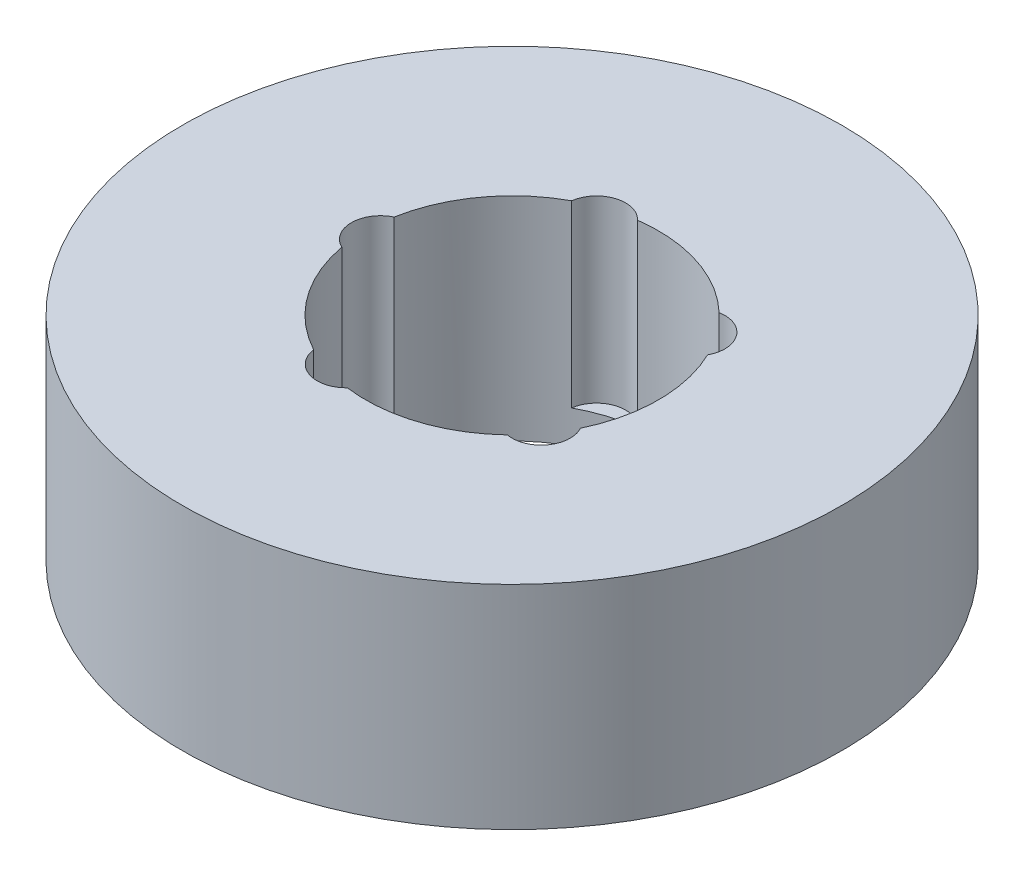
ISO-10303-21;
HEADER;
FILE_DESCRIPTION(('STEP AP214'),'2;1');
FILE_NAME('part.step','',(''),(''),'','','');
FILE_SCHEMA(('AUTOMOTIVE_DESIGN { 1 0 10303 214 1 1 1 1 }'));
ENDSEC;
DATA;
#1=APPLICATION_CONTEXT('core data for automotive mechanical design processes');
#2=APPLICATION_PROTOCOL_DEFINITION('international standard','automotive_design',2000,#1);
#3=PRODUCT_CONTEXT('',#1,'mechanical');
#4=PRODUCT('Part','Part','',(#3));
#5=PRODUCT_RELATED_PRODUCT_CATEGORY('part','',(#4));
#6=PRODUCT_DEFINITION_FORMATION('','',#4);
#7=PRODUCT_DEFINITION_CONTEXT('part definition',#1,'design');
#8=PRODUCT_DEFINITION('design','',#6,#7);
#9=PRODUCT_DEFINITION_SHAPE('','',#8);
#10=(LENGTH_UNIT() NAMED_UNIT(*) SI_UNIT(.MILLI.,.METRE.));
#11=(NAMED_UNIT(*) PLANE_ANGLE_UNIT() SI_UNIT($,.RADIAN.));
#12=(NAMED_UNIT(*) SI_UNIT($,.STERADIAN.) SOLID_ANGLE_UNIT());
#13=UNCERTAINTY_MEASURE_WITH_UNIT(LENGTH_MEASURE(1.E-05),#10,'distance_accuracy_value','');
#14=(GEOMETRIC_REPRESENTATION_CONTEXT(3) GLOBAL_UNCERTAINTY_ASSIGNED_CONTEXT((#13)) GLOBAL_UNIT_ASSIGNED_CONTEXT((#10,
#11,#12)) REPRESENTATION_CONTEXT('',''));
#15=CARTESIAN_POINT('',(0.,0.,0.));
#16=DIRECTION('',(0.,0.,1.));
#17=DIRECTION('',(1.,0.,0.));
#18=AXIS2_PLACEMENT_3D('',#15,#16,#17);
#19=CARTESIAN_POINT('',(0.,29.,0.));
#20=DIRECTION('',(0.,-1.,0.));
#21=DIRECTION('',(0.,0.,-1.));
#22=AXIS2_PLACEMENT_3D('',#19,#20,#21);
#23=CYLINDRICAL_SURFACE('',#22,45.);
#24=CARTESIAN_POINT('',(0.,29.,0.));
#25=DIRECTION('',(0.,1.,0.));
#26=DIRECTION('',(0.,0.,1.));
#27=AXIS2_PLACEMENT_3D('',#24,#25,#26);
#28=CIRCLE('',#27,45.);
#29=CARTESIAN_POINT('',(0.,29.,-45.));
#30=VERTEX_POINT('',#29);
#31=EDGE_CURVE('E151',#30,#30,#28,.T.);
#32=CARTESIAN_POINT('',(0.,0.,0.));
#33=DIRECTION('',(0.,1.,0.));
#34=DIRECTION('',(0.,0.,1.));
#35=AXIS2_PLACEMENT_3D('',#32,#33,#34);
#36=CIRCLE('',#35,45.);
#37=CARTESIAN_POINT('',(0.,0.,-45.));
#38=VERTEX_POINT('',#37);
#39=EDGE_CURVE('E150',#38,#38,#36,.T.);
#40=CARTESIAN_POINT('',(0.,29.,-45.));
#41=CARTESIAN_POINT('',(0.,28.6979166666667,-45.));
#42=CARTESIAN_POINT('',(0.,28.3958333333333,-45.));
#43=CARTESIAN_POINT('',(0.,27.7916666666667,-45.));
#44=CARTESIAN_POINT('',(0.,27.4895833333333,-45.));
#45=CARTESIAN_POINT('',(0.,26.8854166666667,-45.));
#46=CARTESIAN_POINT('',(0.,26.5833333333333,-45.));
#47=CARTESIAN_POINT('',(0.,25.9791666666667,-45.));
#48=CARTESIAN_POINT('',(0.,25.6770833333333,-45.));
#49=CARTESIAN_POINT('',(0.,25.0729166666667,-45.));
#50=CARTESIAN_POINT('',(0.,24.7708333333333,-45.));
#51=CARTESIAN_POINT('',(0.,24.1666666666667,-45.));
#52=CARTESIAN_POINT('',(0.,23.8645833333333,-45.));
#53=CARTESIAN_POINT('',(0.,23.2604166666667,-45.));
#54=CARTESIAN_POINT('',(0.,22.9583333333333,-45.));
#55=CARTESIAN_POINT('',(0.,22.3541666666667,-45.));
#56=CARTESIAN_POINT('',(0.,22.0520833333333,-45.));
#57=CARTESIAN_POINT('',(0.,21.4479166666667,-45.));
#58=CARTESIAN_POINT('',(0.,21.1458333333333,-45.));
#59=CARTESIAN_POINT('',(0.,20.5416666666667,-45.));
#60=CARTESIAN_POINT('',(0.,20.2395833333333,-45.));
#61=CARTESIAN_POINT('',(0.,19.6354166666667,-45.));
#62=CARTESIAN_POINT('',(0.,19.3333333333333,-45.));
#63=CARTESIAN_POINT('',(0.,18.7291666666667,-45.));
#64=CARTESIAN_POINT('',(0.,18.4270833333333,-45.));
#65=CARTESIAN_POINT('',(0.,17.8229166666667,-45.));
#66=CARTESIAN_POINT('',(0.,17.5208333333333,-45.));
#67=CARTESIAN_POINT('',(0.,16.9166666666667,-45.));
#68=CARTESIAN_POINT('',(0.,16.6145833333333,-45.));
#69=CARTESIAN_POINT('',(0.,16.0104166666667,-45.));
#70=CARTESIAN_POINT('',(0.,15.7083333333333,-45.));
#71=CARTESIAN_POINT('',(0.,15.1041666666667,-45.));
#72=CARTESIAN_POINT('',(0.,14.8020833333333,-45.));
#73=CARTESIAN_POINT('',(0.,14.1979166666667,-45.));
#74=CARTESIAN_POINT('',(0.,13.8958333333333,-45.));
#75=CARTESIAN_POINT('',(0.,13.2916666666667,-45.));
#76=CARTESIAN_POINT('',(0.,12.9895833333333,-45.));
#77=CARTESIAN_POINT('',(0.,12.3854166666667,-45.));
#78=CARTESIAN_POINT('',(0.,12.0833333333333,-45.));
#79=CARTESIAN_POINT('',(0.,11.4791666666667,-45.));
#80=CARTESIAN_POINT('',(0.,11.1770833333333,-45.));
#81=CARTESIAN_POINT('',(0.,10.5729166666667,-45.));
#82=CARTESIAN_POINT('',(0.,10.2708333333333,-45.));
#83=CARTESIAN_POINT('',(0.,9.66666666666667,-45.));
#84=CARTESIAN_POINT('',(0.,9.36458333333333,-45.));
#85=CARTESIAN_POINT('',(0.,8.76041666666667,-45.));
#86=CARTESIAN_POINT('',(0.,8.45833333333333,-45.));
#87=CARTESIAN_POINT('',(0.,7.85416666666667,-45.));
#88=CARTESIAN_POINT('',(0.,7.55208333333333,-45.));
#89=CARTESIAN_POINT('',(0.,6.94791666666667,-45.));
#90=CARTESIAN_POINT('',(0.,6.64583333333333,-45.));
#91=CARTESIAN_POINT('',(0.,6.04166666666667,-45.));
#92=CARTESIAN_POINT('',(0.,5.73958333333333,-45.));
#93=CARTESIAN_POINT('',(0.,5.13541666666667,-45.));
#94=CARTESIAN_POINT('',(0.,4.83333333333333,-45.));
#95=CARTESIAN_POINT('',(0.,4.22916666666667,-45.));
#96=CARTESIAN_POINT('',(0.,3.92708333333333,-45.));
#97=CARTESIAN_POINT('',(0.,3.32291666666667,-45.));
#98=CARTESIAN_POINT('',(0.,3.02083333333333,-45.));
#99=CARTESIAN_POINT('',(0.,2.41666666666667,-45.));
#100=CARTESIAN_POINT('',(0.,2.11458333333333,-45.));
#101=CARTESIAN_POINT('',(0.,1.51041666666667,-45.));
#102=CARTESIAN_POINT('',(0.,1.20833333333333,-45.));
#103=CARTESIAN_POINT('',(0.,0.604166666666667,-45.));
#104=CARTESIAN_POINT('',(0.,0.302083333333333,-45.));
#105=CARTESIAN_POINT('',(0.,0.,-45.));
#106=B_SPLINE_CURVE_WITH_KNOTS('',3,(#40,#41,#42,#43,#44,#45,#46,#47,#48,#49,#50,#51,#52,#53,
#54,#55,#56,#57,#58,#59,#60,#61,#62,#63,#64,#65,#66,#67,#68,#69,#70,#71,#72,#73,#74,#75,#76,#77,
#78,#79,#80,#81,#82,#83,#84,#85,#86,#87,#88,#89,#90,#91,#92,#93,#94,#95,#96,#97,#98,#99,#100,
#101,#102,#103,#104,#105),.UNSPECIFIED.,.F.,.F.,(4,2,2,2,2,2,2,2,2,2,2,2,2,2,2,2,2,2,2,2,2,2,2,
2,2,2,2,2,2,2,2,2,4),(0.,0.906249999999997,1.8125,2.71875,3.625,4.53125,5.4375,6.34375,7.25,
8.15625,9.0625,9.96875,10.875,11.78125,12.6875,13.59375,14.5,15.40625,16.3125,17.21875,18.125,
19.03125,19.9375,20.84375,21.75,22.65625,23.5625,24.46875,25.375,26.28125,27.1875,28.09375,29.),.UNSPECIFIED.);
#107=EDGE_CURVE('BSEAM39',#30,#38,#106,.T.);
#108=ORIENTED_EDGE('',*,*,#31,.F.);
#109=ORIENTED_EDGE('',*,*,#39,.T.);
#110=ORIENTED_EDGE('',*,*,#107,.T.);
#111=ORIENTED_EDGE('',*,*,#107,.F.);
#112=EDGE_LOOP('',(#108,#110,#109,#111));
#113=FACE_BOUND('',#112,.T.);
#114=ADVANCED_FACE('F39',(#113),#23,.T.);
#115=CARTESIAN_POINT('',(0.,29.,0.));
#116=DIRECTION('',(0.,1.,0.));
#117=DIRECTION('',(0.,0.,1.));
#118=AXIS2_PLACEMENT_3D('',#115,#116,#117);
#119=PLANE('',#118);
#120=CARTESIAN_POINT('',(-5.55341093640592,29.,-17.0916414141449));
#121=DIRECTION('',(0.,1.,0.));
#122=DIRECTION('',(-0.95105651629515,0.,0.309016994374958));
#123=AXIS2_PLACEMENT_3D('',#120,#121,#122);
#124=CIRCLE('',#123,3.96081850170651);
#125=CARTESIAN_POINT('',(-2.68159035838854,29.,-19.8194115238015));
#126=VERTEX_POINT('',#125);
#127=CARTESIAN_POINT('',(-9.48010563091811,29.,-17.6104400066164));
#128=VERTEX_POINT('',#127);
#129=EDGE_CURVE('E196',#126,#128,#124,.T.);
#130=ORIENTED_EDGE('',*,*,#129,.F.);
#131=CARTESIAN_POINT('',(0.,29.,0.));
#132=DIRECTION('',(0.,1.,0.));
#133=DIRECTION('',(0.,0.,1.));
#134=AXIS2_PLACEMENT_3D('',#131,#132,#133);
#135=CIRCLE('',#134,20.);
#136=CARTESIAN_POINT('',(13.8190099746941,29.,-14.4580414759159));
#137=VERTEX_POINT('',#136);
#138=EDGE_CURVE('E156',#137,#126,#135,.T.);
#139=ORIENTED_EDGE('',*,*,#138,.F.);
#140=CARTESIAN_POINT('',(14.5390185850055,29.,-10.563215317467));
#141=DIRECTION('',(0.,1.,0.));
#142=DIRECTION('',(-0.58778525229248,0.,-0.809016994374942));
#143=AXIS2_PLACEMENT_3D('',#140,#141,#142);
#144=CIRCLE('',#143,3.96081850170651);
#145=CARTESIAN_POINT('',(18.0207234861527,29.,-8.67487896374498));
#146=VERTEX_POINT('',#145);
#147=EDGE_CURVE('E254',#146,#137,#144,.T.);
#148=ORIENTED_EDGE('',*,*,#147,.F.);
#149=CARTESIAN_POINT('',(18.0207234861528,29.,8.67487896374472));
#150=VERTEX_POINT('',#149);
#151=EDGE_CURVE('E153',#150,#146,#135,.T.);
#152=ORIENTED_EDGE('',*,*,#151,.F.);
#153=CARTESIAN_POINT('',(14.5390185850056,29.,10.5632153174668));
#154=DIRECTION('',(0.,1.,0.));
#155=DIRECTION('',(0.587785252292469,0.,-0.809016994374951));
#156=AXIS2_PLACEMENT_3D('',#153,#154,#155);
#157=CIRCLE('',#156,3.96081850170651);
#158=CARTESIAN_POINT('',(13.8190099746943,29.,14.4580414759157));
#159=VERTEX_POINT('',#158);
#160=EDGE_CURVE('E248',#159,#150,#157,.T.);
#161=ORIENTED_EDGE('',*,*,#160,.F.);
#162=CARTESIAN_POINT('',(-2.68159035838826,29.,19.8194115238016));
#163=VERTEX_POINT('',#162);
#164=EDGE_CURVE('E140',#163,#159,#135,.T.);
#165=ORIENTED_EDGE('',*,*,#164,.F.);
#166=CARTESIAN_POINT('',(-5.55341093640568,29.,17.0916414141449));
#167=DIRECTION('',(0.,1.,0.));
#168=DIRECTION('',(0.951056516295155,0.,0.309016994374945));
#169=AXIS2_PLACEMENT_3D('',#166,#167,#168);
#170=CIRCLE('',#169,3.96081850170651);
#171=CARTESIAN_POINT('',(-9.48010563091786,29.,17.6104400066165));
#172=VERTEX_POINT('',#171);
#173=EDGE_CURVE('E117',#172,#163,#170,.T.);
#174=ORIENTED_EDGE('',*,*,#173,.F.);
#175=CARTESIAN_POINT('',(-19.6780374715407,29.,3.5741909949859));
#176=VERTEX_POINT('',#175);
#177=EDGE_CURVE('E133',#176,#172,#135,.T.);
#178=ORIENTED_EDGE('',*,*,#177,.F.);
#179=CARTESIAN_POINT('',(-17.9712152971997,29.,0.));
#180=DIRECTION('',(0.,1.,0.));
#181=DIRECTION('',(0.,0.,1.));
#182=AXIS2_PLACEMENT_3D('',#179,#180,#181);
#183=CIRCLE('',#182,3.96081850170651);
#184=CARTESIAN_POINT('',(-19.6780374715407,29.,-3.5741909949859));
#185=VERTEX_POINT('',#184);
#186=EDGE_CURVE('E170',#185,#176,#183,.T.);
#187=ORIENTED_EDGE('',*,*,#186,.F.);
#188=EDGE_CURVE('E149',#128,#185,#135,.T.);
#189=ORIENTED_EDGE('',*,*,#188,.F.);
#190=EDGE_LOOP('',(#130,#139,#148,#152,#161,#165,#174,#178,#187,#189));
#191=FACE_BOUND('',#190,.T.);
#192=ORIENTED_EDGE('',*,*,#31,.T.);
#193=EDGE_LOOP('',(#192));
#194=FACE_BOUND('',#193,.T.);
#195=ADVANCED_FACE('F131',(#191,#194),#119,.T.);
#196=CARTESIAN_POINT('',(0.,0.,0.));
#197=DIRECTION('',(0.,1.,0.));
#198=DIRECTION('',(0.,0.,1.));
#199=AXIS2_PLACEMENT_3D('',#196,#197,#198);
#200=PLANE('',#199);
#201=CARTESIAN_POINT('',(0.,0.,0.));
#202=DIRECTION('',(0.,1.,0.));
#203=DIRECTION('',(0.,0.,1.));
#204=AXIS2_PLACEMENT_3D('',#201,#202,#203);
#205=CIRCLE('',#204,20.);
#206=CARTESIAN_POINT('',(0.,0.,20.));
#207=VERTEX_POINT('',#206);
#208=EDGE_CURVE('E160',#207,#207,#205,.T.);
#209=ORIENTED_EDGE('',*,*,#208,.T.);
#210=EDGE_LOOP('',(#209));
#211=FACE_BOUND('',#210,.T.);
#212=ORIENTED_EDGE('',*,*,#39,.F.);
#213=EDGE_LOOP('',(#212));
#214=FACE_BOUND('',#213,.T.);
#215=ADVANCED_FACE('F212',(#211,#214),#200,.F.);
#216=CARTESIAN_POINT('',(0.,29.,0.));
#217=DIRECTION('',(0.,-1.,0.));
#218=DIRECTION('',(0.,0.,-1.));
#219=AXIS2_PLACEMENT_3D('',#216,#217,#218);
#220=CYLINDRICAL_SURFACE('',#219,20.);
#221=DIRECTION('',(0.,1.,0.));
#222=VECTOR('',#221,1.);
#223=CARTESIAN_POINT('',(-2.68159035838854,16.7498678070132,-19.8194115238015));
#224=LINE('',#223,#222);
#225=CARTESIAN_POINT('',(-2.68159035838854,4.49973561402637,-19.8194115238015));
#226=VERTEX_POINT('',#225);
#227=EDGE_CURVE('E11',#226,#126,#224,.T.);
#228=ORIENTED_EDGE('',*,*,#227,.F.);
#229=CARTESIAN_POINT('',(0.,4.49973561402637,0.));
#230=DIRECTION('',(0.,1.,0.));
#231=DIRECTION('',(0.,0.,1.));
#232=AXIS2_PLACEMENT_3D('',#229,#230,#231);
#233=CIRCLE('',#232,20.);
#234=CARTESIAN_POINT('',(-9.48010563091811,4.49973561402637,-17.6104400066164));
#235=VERTEX_POINT('',#234);
#236=EDGE_CURVE('E193',#226,#235,#233,.T.);
#237=ORIENTED_EDGE('',*,*,#236,.T.);
#238=DIRECTION('',(0.,1.,0.));
#239=VECTOR('',#238,1.);
#240=CARTESIAN_POINT('',(-9.48010563091811,16.7498678070132,-17.6104400066164));
#241=LINE('',#240,#239);
#242=EDGE_CURVE('E46',#128,#235,#241,.F.);
#243=ORIENTED_EDGE('',*,*,#242,.F.);
#244=ORIENTED_EDGE('',*,*,#188,.T.);
#245=DIRECTION('',(0.,1.,0.));
#246=VECTOR('',#245,1.);
#247=CARTESIAN_POINT('',(-19.6780374715407,16.7498678070132,-3.5741909949859));
#248=LINE('',#247,#246);
#249=CARTESIAN_POINT('',(-19.6780374715407,4.49973561402637,-3.5741909949859));
#250=VERTEX_POINT('',#249);
#251=EDGE_CURVE('E174',#250,#185,#248,.T.);
#252=ORIENTED_EDGE('',*,*,#251,.F.);
#253=CARTESIAN_POINT('',(0.,4.49973561402637,0.));
#254=DIRECTION('',(0.,1.,0.));
#255=DIRECTION('',(0.,0.,1.));
#256=AXIS2_PLACEMENT_3D('',#253,#254,#255);
#257=CIRCLE('',#256,20.);
#258=CARTESIAN_POINT('',(-19.6780374715407,4.49973561402637,3.5741909949859));
#259=VERTEX_POINT('',#258);
#260=EDGE_CURVE('E171',#250,#259,#257,.T.);
#261=ORIENTED_EDGE('',*,*,#260,.T.);
#262=DIRECTION('',(0.,1.,0.));
#263=VECTOR('',#262,1.);
#264=CARTESIAN_POINT('',(-19.6780374715407,16.7498678070132,3.5741909949859));
#265=LINE('',#264,#263);
#266=EDGE_CURVE('E148',#176,#259,#265,.F.);
#267=ORIENTED_EDGE('',*,*,#266,.F.);
#268=ORIENTED_EDGE('',*,*,#177,.T.);
#269=DIRECTION('',(0.,1.,0.));
#270=VECTOR('',#269,1.);
#271=CARTESIAN_POINT('',(-9.48010563091786,16.7498678070132,17.6104400066165));
#272=LINE('',#271,#270);
#273=CARTESIAN_POINT('',(-9.48010563091786,4.49973561402637,17.6104400066165));
#274=VERTEX_POINT('',#273);
#275=EDGE_CURVE('E111',#274,#172,#272,.T.);
#276=ORIENTED_EDGE('',*,*,#275,.F.);
#277=CARTESIAN_POINT('',(0.,4.49973561402637,0.));
#278=DIRECTION('',(0.,1.,0.));
#279=DIRECTION('',(0.,0.,1.));
#280=AXIS2_PLACEMENT_3D('',#277,#278,#279);
#281=CIRCLE('',#280,20.);
#282=CARTESIAN_POINT('',(-2.68159035838826,4.49973561402637,19.8194115238016));
#283=VERTEX_POINT('',#282);
#284=EDGE_CURVE('E180',#274,#283,#281,.T.);
#285=ORIENTED_EDGE('',*,*,#284,.T.);
#286=DIRECTION('',(0.,1.,0.));
#287=VECTOR('',#286,1.);
#288=CARTESIAN_POINT('',(-2.68159035838826,16.7498678070132,19.8194115238016));
#289=LINE('',#288,#287);
#290=EDGE_CURVE('E124',#163,#283,#289,.F.);
#291=ORIENTED_EDGE('',*,*,#290,.F.);
#292=ORIENTED_EDGE('',*,*,#164,.T.);
#293=DIRECTION('',(0.,1.,0.));
#294=VECTOR('',#293,1.);
#295=CARTESIAN_POINT('',(13.8190099746943,16.7498678070132,14.4580414759157));
#296=LINE('',#295,#294);
#297=CARTESIAN_POINT('',(13.8190099746943,4.49973561402637,14.4580414759157));
#298=VERTEX_POINT('',#297);
#299=EDGE_CURVE('E183',#298,#159,#296,.T.);
#300=ORIENTED_EDGE('',*,*,#299,.F.);
#301=CARTESIAN_POINT('',(0.,4.49973561402637,0.));
#302=DIRECTION('',(0.,1.,0.));
#303=DIRECTION('',(0.,0.,1.));
#304=AXIS2_PLACEMENT_3D('',#301,#302,#303);
#305=CIRCLE('',#304,20.);
#306=CARTESIAN_POINT('',(18.0207234861528,4.49973561402637,8.67487896374472));
#307=VERTEX_POINT('',#306);
#308=EDGE_CURVE('E123',#298,#307,#305,.T.);
#309=ORIENTED_EDGE('',*,*,#308,.T.);
#310=DIRECTION('',(0.,1.,0.));
#311=VECTOR('',#310,1.);
#312=CARTESIAN_POINT('',(18.0207234861528,16.7498678070132,8.67487896374472));
#313=LINE('',#312,#311);
#314=EDGE_CURVE('E185',#150,#307,#313,.F.);
#315=ORIENTED_EDGE('',*,*,#314,.F.);
#316=ORIENTED_EDGE('',*,*,#151,.T.);
#317=DIRECTION('',(0.,1.,0.));
#318=VECTOR('',#317,1.);
#319=CARTESIAN_POINT('',(18.0207234861527,16.7498678070132,-8.67487896374498));
#320=LINE('',#319,#318);
#321=CARTESIAN_POINT('',(18.0207234861527,4.49973561402637,-8.67487896374498));
#322=VERTEX_POINT('',#321);
#323=EDGE_CURVE('E195',#322,#146,#320,.T.);
#324=ORIENTED_EDGE('',*,*,#323,.F.);
#325=CARTESIAN_POINT('',(0.,4.49973561402637,0.));
#326=DIRECTION('',(0.,1.,0.));
#327=DIRECTION('',(0.,0.,1.));
#328=AXIS2_PLACEMENT_3D('',#325,#326,#327);
#329=CIRCLE('',#328,20.);
#330=CARTESIAN_POINT('',(13.8190099746941,4.49973561402637,-14.4580414759159));
#331=VERTEX_POINT('',#330);
#332=EDGE_CURVE('E190',#322,#331,#329,.T.);
#333=ORIENTED_EDGE('',*,*,#332,.T.);
#334=DIRECTION('',(0.,1.,0.));
#335=VECTOR('',#334,1.);
#336=CARTESIAN_POINT('',(13.8190099746941,16.7498678070132,-14.4580414759159));
#337=LINE('',#336,#335);
#338=EDGE_CURVE('E189',#137,#331,#337,.F.);
#339=ORIENTED_EDGE('',*,*,#338,.F.);
#340=ORIENTED_EDGE('',*,*,#138,.T.);
#341=EDGE_LOOP('',(#228,#237,#243,#244,#252,#261,#267,#268,#276,#285,#291,#292,#300,#309,#315,
#316,#324,#333,#339,#340));
#342=FACE_BOUND('',#341,.T.);
#343=ORIENTED_EDGE('',*,*,#208,.F.);
#344=EDGE_LOOP('',(#343));
#345=FACE_BOUND('',#344,.T.);
#346=ADVANCED_FACE('F142',(#342,#345),#220,.F.);
#347=CARTESIAN_POINT('',(-17.9712152971997,4.49973561402637,0.));
#348=DIRECTION('',(0.,1.,0.));
#349=DIRECTION('',(0.,0.,1.));
#350=AXIS2_PLACEMENT_3D('',#347,#348,#349);
#351=CYLINDRICAL_SURFACE('',#350,3.96081850170651);
#352=ORIENTED_EDGE('',*,*,#251,.T.);
#353=ORIENTED_EDGE('',*,*,#186,.T.);
#354=ORIENTED_EDGE('',*,*,#266,.T.);
#355=CARTESIAN_POINT('',(-17.9712152971997,4.49973561402637,0.));
#356=DIRECTION('',(0.,1.,0.));
#357=DIRECTION('',(0.,0.,1.));
#358=AXIS2_PLACEMENT_3D('',#355,#356,#357);
#359=CIRCLE('',#358,3.96081850170651);
#360=EDGE_CURVE('E163',#250,#259,#359,.T.);
#361=ORIENTED_EDGE('',*,*,#360,.F.);
#362=EDGE_LOOP('',(#352,#353,#354,#361));
#363=FACE_BOUND('',#362,.T.);
#364=ADVANCED_FACE('F221',(#363),#351,.F.);
#365=CARTESIAN_POINT('',(-17.9712152971997,4.49973561402637,0.));
#366=DIRECTION('',(0.,1.,0.));
#367=DIRECTION('',(0.,0.,1.));
#368=AXIS2_PLACEMENT_3D('',#365,#366,#367);
#369=PLANE('',#368);
#370=ORIENTED_EDGE('',*,*,#360,.T.);
#371=ORIENTED_EDGE('',*,*,#260,.F.);
#372=EDGE_LOOP('',(#370,#371));
#373=FACE_BOUND('',#372,.T.);
#374=ADVANCED_FACE('F227',(#373),#369,.T.);
#375=CARTESIAN_POINT('',(-5.55341093640568,4.49973561402637,17.0916414141449));
#376=DIRECTION('',(0.,1.,0.));
#377=DIRECTION('',(0.,0.,1.));
#378=AXIS2_PLACEMENT_3D('',#375,#376,#377);
#379=CYLINDRICAL_SURFACE('',#378,3.96081850170651);
#380=ORIENTED_EDGE('',*,*,#275,.T.);
#381=ORIENTED_EDGE('',*,*,#173,.T.);
#382=ORIENTED_EDGE('',*,*,#290,.T.);
#383=CARTESIAN_POINT('',(-5.55341093640568,4.49973561402637,17.0916414141449));
#384=DIRECTION('',(0.,1.,0.));
#385=DIRECTION('',(0.951056516295155,0.,0.309016994374945));
#386=AXIS2_PLACEMENT_3D('',#383,#384,#385);
#387=CIRCLE('',#386,3.96081850170651);
#388=EDGE_CURVE('E119',#274,#283,#387,.T.);
#389=ORIENTED_EDGE('',*,*,#388,.F.);
#390=EDGE_LOOP('',(#380,#381,#382,#389));
#391=FACE_BOUND('',#390,.T.);
#392=ADVANCED_FACE('F116',(#391),#379,.F.);
#393=CARTESIAN_POINT('',(-5.55341093640568,4.49973561402637,17.0916414141449));
#394=DIRECTION('',(0.,1.,0.));
#395=DIRECTION('',(0.951056516295155,0.,0.309016994374945));
#396=AXIS2_PLACEMENT_3D('',#393,#394,#395);
#397=PLANE('',#396);
#398=ORIENTED_EDGE('',*,*,#388,.T.);
#399=ORIENTED_EDGE('',*,*,#284,.F.);
#400=EDGE_LOOP('',(#398,#399));
#401=FACE_BOUND('',#400,.T.);
#402=ADVANCED_FACE('F234',(#401),#397,.T.);
#403=CARTESIAN_POINT('',(14.5390185850056,4.49973561402637,10.5632153174668));
#404=DIRECTION('',(0.,1.,0.));
#405=DIRECTION('',(0.,0.,1.));
#406=AXIS2_PLACEMENT_3D('',#403,#404,#405);
#407=CYLINDRICAL_SURFACE('',#406,3.96081850170651);
#408=ORIENTED_EDGE('',*,*,#299,.T.);
#409=ORIENTED_EDGE('',*,*,#160,.T.);
#410=ORIENTED_EDGE('',*,*,#314,.T.);
#411=CARTESIAN_POINT('',(14.5390185850056,4.49973561402637,10.5632153174668));
#412=DIRECTION('',(0.,1.,0.));
#413=DIRECTION('',(0.587785252292469,0.,-0.809016994374951));
#414=AXIS2_PLACEMENT_3D('',#411,#412,#413);
#415=CIRCLE('',#414,3.96081850170651);
#416=EDGE_CURVE('E137',#298,#307,#415,.T.);
#417=ORIENTED_EDGE('',*,*,#416,.F.);
#418=EDGE_LOOP('',(#408,#409,#410,#417));
#419=FACE_BOUND('',#418,.T.);
#420=ADVANCED_FACE('F240',(#419),#407,.F.);
#421=CARTESIAN_POINT('',(14.5390185850056,4.49973561402637,10.5632153174668));
#422=DIRECTION('',(0.,1.,0.));
#423=DIRECTION('',(0.587785252292469,0.,-0.809016994374951));
#424=AXIS2_PLACEMENT_3D('',#421,#422,#423);
#425=PLANE('',#424);
#426=ORIENTED_EDGE('',*,*,#416,.T.);
#427=ORIENTED_EDGE('',*,*,#308,.F.);
#428=EDGE_LOOP('',(#426,#427));
#429=FACE_BOUND('',#428,.T.);
#430=ADVANCED_FACE('F245',(#429),#425,.T.);
#431=CARTESIAN_POINT('',(14.5390185850055,4.49973561402637,-10.563215317467));
#432=DIRECTION('',(0.,1.,0.));
#433=DIRECTION('',(0.,0.,1.));
#434=AXIS2_PLACEMENT_3D('',#431,#432,#433);
#435=CYLINDRICAL_SURFACE('',#434,3.96081850170651);
#436=ORIENTED_EDGE('',*,*,#323,.T.);
#437=ORIENTED_EDGE('',*,*,#147,.T.);
#438=ORIENTED_EDGE('',*,*,#338,.T.);
#439=CARTESIAN_POINT('',(14.5390185850055,4.49973561402637,-10.563215317467));
#440=DIRECTION('',(0.,1.,0.));
#441=DIRECTION('',(-0.58778525229248,0.,-0.809016994374942));
#442=AXIS2_PLACEMENT_3D('',#439,#440,#441);
#443=CIRCLE('',#442,3.96081850170651);
#444=EDGE_CURVE('E56',#322,#331,#443,.T.);
#445=ORIENTED_EDGE('',*,*,#444,.F.);
#446=EDGE_LOOP('',(#436,#437,#438,#445));
#447=FACE_BOUND('',#446,.T.);
#448=ADVANCED_FACE('F264',(#447),#435,.F.);
#449=CARTESIAN_POINT('',(14.5390185850055,4.49973561402637,-10.563215317467));
#450=DIRECTION('',(0.,1.,0.));
#451=DIRECTION('',(-0.58778525229248,0.,-0.809016994374942));
#452=AXIS2_PLACEMENT_3D('',#449,#450,#451);
#453=PLANE('',#452);
#454=ORIENTED_EDGE('',*,*,#444,.T.);
#455=ORIENTED_EDGE('',*,*,#332,.F.);
#456=EDGE_LOOP('',(#454,#455));
#457=FACE_BOUND('',#456,.T.);
#458=ADVANCED_FACE('F202',(#457),#453,.T.);
#459=CARTESIAN_POINT('',(-5.55341093640592,4.49973561402637,-17.0916414141449));
#460=DIRECTION('',(0.,1.,0.));
#461=DIRECTION('',(0.,0.,1.));
#462=AXIS2_PLACEMENT_3D('',#459,#460,#461);
#463=CYLINDRICAL_SURFACE('',#462,3.96081850170651);
#464=ORIENTED_EDGE('',*,*,#227,.T.);
#465=ORIENTED_EDGE('',*,*,#129,.T.);
#466=ORIENTED_EDGE('',*,*,#242,.T.);
#467=CARTESIAN_POINT('',(-5.55341093640592,4.49973561402637,-17.0916414141449));
#468=DIRECTION('',(0.,1.,0.));
#469=DIRECTION('',(-0.95105651629515,0.,0.309016994374958));
#470=AXIS2_PLACEMENT_3D('',#467,#468,#469);
#471=CIRCLE('',#470,3.96081850170651);
#472=EDGE_CURVE('E55',#226,#235,#471,.T.);
#473=ORIENTED_EDGE('',*,*,#472,.F.);
#474=EDGE_LOOP('',(#464,#465,#466,#473));
#475=FACE_BOUND('',#474,.T.);
#476=ADVANCED_FACE('F197',(#475),#463,.F.);
#477=CARTESIAN_POINT('',(-5.55341093640592,4.49973561402637,-17.0916414141449));
#478=DIRECTION('',(0.,1.,0.));
#479=DIRECTION('',(-0.95105651629515,0.,0.309016994374958));
#480=AXIS2_PLACEMENT_3D('',#477,#478,#479);
#481=PLANE('',#480);
#482=ORIENTED_EDGE('',*,*,#472,.T.);
#483=ORIENTED_EDGE('',*,*,#236,.F.);
#484=EDGE_LOOP('',(#482,#483));
#485=FACE_BOUND('',#484,.T.);
#486=ADVANCED_FACE('F200',(#485),#481,.T.);
#487=CLOSED_SHELL('',(#114,#195,#215,#346,#364,#374,#392,#402,#420,#430,#448,#458,#476,#486));
#488=MANIFOLD_SOLID_BREP('B2',#487);
#489=ADVANCED_BREP_SHAPE_REPRESENTATION('',(#18,#488),#14);
#490=SHAPE_DEFINITION_REPRESENTATION(#9,#489);
ENDSEC;
END-ISO-10303-21;
